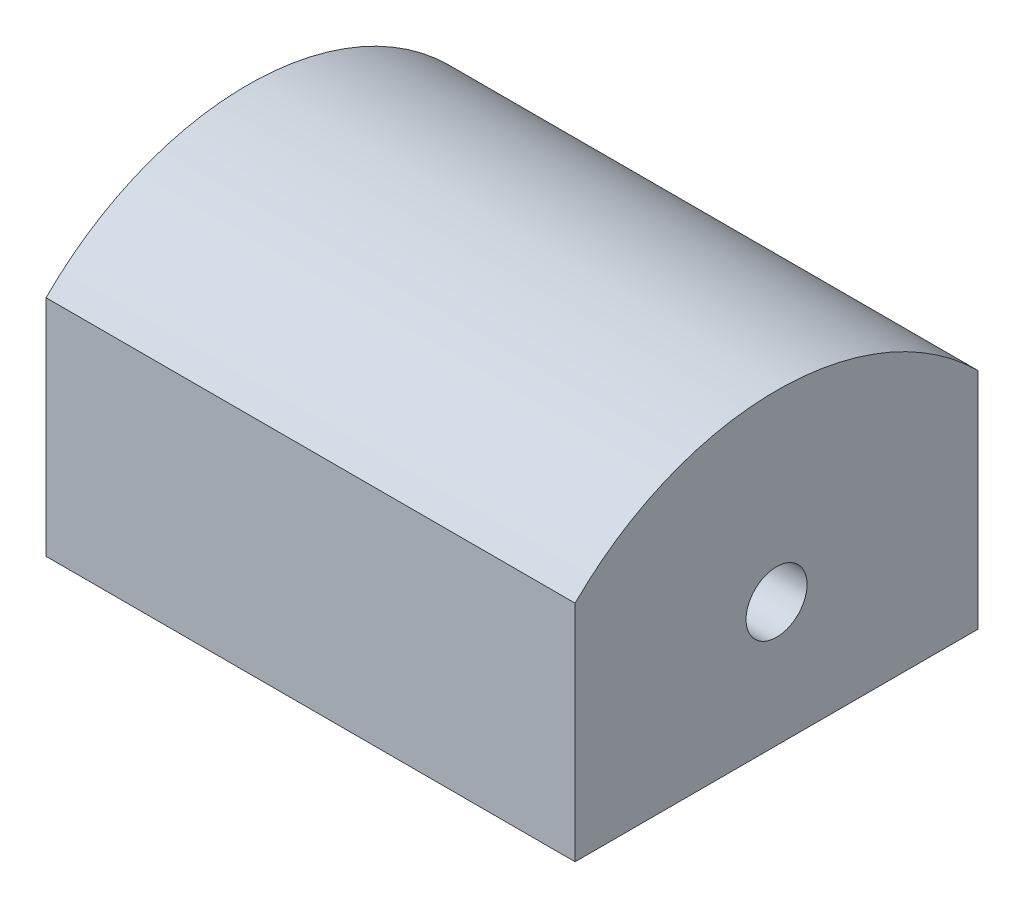
ISO-10303-21;
HEADER;
FILE_DESCRIPTION(('STEP AP214'),'2;1');
FILE_NAME('part.step','',(''),(''),'','','');
FILE_SCHEMA(('AUTOMOTIVE_DESIGN { 1 0 10303 214 1 1 1 1 }'));
ENDSEC;
DATA;
#1=APPLICATION_CONTEXT('core data for automotive mechanical design processes');
#2=APPLICATION_PROTOCOL_DEFINITION('international standard','automotive_design',2000,#1);
#3=PRODUCT_CONTEXT('',#1,'mechanical');
#4=PRODUCT('Part','Part','',(#3));
#5=PRODUCT_RELATED_PRODUCT_CATEGORY('part','',(#4));
#6=PRODUCT_DEFINITION_FORMATION('','',#4);
#7=PRODUCT_DEFINITION_CONTEXT('part definition',#1,'design');
#8=PRODUCT_DEFINITION('design','',#6,#7);
#9=PRODUCT_DEFINITION_SHAPE('','',#8);
#10=(LENGTH_UNIT() NAMED_UNIT(*) SI_UNIT(.MILLI.,.METRE.));
#11=(NAMED_UNIT(*) PLANE_ANGLE_UNIT() SI_UNIT($,.RADIAN.));
#12=(NAMED_UNIT(*) SI_UNIT($,.STERADIAN.) SOLID_ANGLE_UNIT());
#13=UNCERTAINTY_MEASURE_WITH_UNIT(LENGTH_MEASURE(1.E-05),#10,'distance_accuracy_value','');
#14=(GEOMETRIC_REPRESENTATION_CONTEXT(3) GLOBAL_UNCERTAINTY_ASSIGNED_CONTEXT((#13)) GLOBAL_UNIT_ASSIGNED_CONTEXT((#10,
#11,#12)) REPRESENTATION_CONTEXT('',''));
#15=CARTESIAN_POINT('',(0.,0.,0.));
#16=DIRECTION('',(0.,0.,1.));
#17=DIRECTION('',(1.,0.,0.));
#18=AXIS2_PLACEMENT_3D('',#15,#16,#17);
#19=CARTESIAN_POINT('',(13.,5.50382367744455,0.));
#20=DIRECTION('',(0.,0.,1.));
#21=DIRECTION('',(1.,0.,0.));
#22=AXIS2_PLACEMENT_3D('',#19,#20,#21);
#23=PLANE('',#22);
#24=DIRECTION('',(0.,1.,0.));
#25=VECTOR('',#24,1.);
#26=CARTESIAN_POINT('',(0.,5.50382367744455,0.));
#27=LINE('',#26,#25);
#28=CARTESIAN_POINT('',(0.,0.,0.));
#29=VERTEX_POINT('',#28);
#30=CARTESIAN_POINT('',(0.,5.50382367744455,0.));
#31=VERTEX_POINT('',#30);
#32=EDGE_CURVE('E107',#29,#31,#27,.T.);
#33=ORIENTED_EDGE('',*,*,#32,.T.);
#34=DIRECTION('',(-1.,0.,0.));
#35=VECTOR('',#34,1.);
#36=CARTESIAN_POINT('',(13.,5.50382367744455,0.));
#37=LINE('',#36,#35);
#38=CARTESIAN_POINT('',(13.,5.50382367744455,0.));
#39=VERTEX_POINT('',#38);
#40=EDGE_CURVE('E11',#39,#31,#37,.T.);
#41=ORIENTED_EDGE('',*,*,#40,.F.);
#42=DIRECTION('',(0.,1.,0.));
#43=VECTOR('',#42,1.);
#44=CARTESIAN_POINT('',(13.,5.50382367744455,0.));
#45=LINE('',#44,#43);
#46=CARTESIAN_POINT('',(13.,0.,0.));
#47=VERTEX_POINT('',#46);
#48=EDGE_CURVE('E91',#47,#39,#45,.T.);
#49=ORIENTED_EDGE('',*,*,#48,.F.);
#50=DIRECTION('',(-1.,0.,0.));
#51=VECTOR('',#50,1.);
#52=CARTESIAN_POINT('',(13.,0.,0.));
#53=LINE('',#52,#51);
#54=EDGE_CURVE('E103',#47,#29,#53,.T.);
#55=ORIENTED_EDGE('',*,*,#54,.T.);
#56=EDGE_LOOP('',(#33,#41,#49,#55));
#57=FACE_BOUND('',#56,.T.);
#58=ADVANCED_FACE('F39',(#57),#23,.F.);
#59=CARTESIAN_POINT('',(13.,0.55407620913872,4.94974746830584));
#60=DIRECTION('',(-1.,0.,0.));
#61=DIRECTION('',(0.,0.,1.));
#62=AXIS2_PLACEMENT_3D('',#59,#60,#61);
#63=CYLINDRICAL_SURFACE('',#62,7.);
#64=CARTESIAN_POINT('',(0.,0.55407620913872,4.94974746830584));
#65=DIRECTION('',(1.,0.,0.));
#66=DIRECTION('',(0.,0.,1.));
#67=AXIS2_PLACEMENT_3D('',#64,#65,#66);
#68=CIRCLE('',#67,7.);
#69=CARTESIAN_POINT('',(0.,5.50382367744455,9.89949493661167));
#70=VERTEX_POINT('',#69);
#71=EDGE_CURVE('E96',#31,#70,#68,.T.);
#72=ORIENTED_EDGE('',*,*,#71,.T.);
#73=DIRECTION('',(-1.,0.,0.));
#74=VECTOR('',#73,1.);
#75=CARTESIAN_POINT('',(13.,5.50382367744455,9.89949493661167));
#76=LINE('',#75,#74);
#77=CARTESIAN_POINT('',(13.,5.50382367744455,9.89949493661167));
#78=VERTEX_POINT('',#77);
#79=EDGE_CURVE('E48',#78,#70,#76,.T.);
#80=ORIENTED_EDGE('',*,*,#79,.F.);
#81=CARTESIAN_POINT('',(13.,0.55407620913872,4.94974746830584));
#82=DIRECTION('',(1.,0.,0.));
#83=DIRECTION('',(0.,0.,1.));
#84=AXIS2_PLACEMENT_3D('',#81,#82,#83);
#85=CIRCLE('',#84,7.);
#86=EDGE_CURVE('E86',#39,#78,#85,.T.);
#87=ORIENTED_EDGE('',*,*,#86,.F.);
#88=ORIENTED_EDGE('',*,*,#40,.T.);
#89=EDGE_LOOP('',(#72,#80,#87,#88));
#90=FACE_BOUND('',#89,.T.);
#91=ADVANCED_FACE('F95',(#90),#63,.T.);
#92=CARTESIAN_POINT('',(13.,0.,9.89949493661167));
#93=DIRECTION('',(0.,0.,-1.));
#94=DIRECTION('',(-1.,0.,0.));
#95=AXIS2_PLACEMENT_3D('',#92,#93,#94);
#96=PLANE('',#95);
#97=DIRECTION('',(0.,-1.,0.));
#98=VECTOR('',#97,1.);
#99=CARTESIAN_POINT('',(0.,0.,9.89949493661167));
#100=LINE('',#99,#98);
#101=CARTESIAN_POINT('',(0.,0.,9.89949493661167));
#102=VERTEX_POINT('',#101);
#103=EDGE_CURVE('E73',#70,#102,#100,.T.);
#104=ORIENTED_EDGE('',*,*,#103,.T.);
#105=DIRECTION('',(-1.,0.,0.));
#106=VECTOR('',#105,1.);
#107=CARTESIAN_POINT('',(13.,0.,9.89949493661167));
#108=LINE('',#107,#106);
#109=CARTESIAN_POINT('',(13.,0.,9.89949493661167));
#110=VERTEX_POINT('',#109);
#111=EDGE_CURVE('E98',#110,#102,#108,.T.);
#112=ORIENTED_EDGE('',*,*,#111,.F.);
#113=DIRECTION('',(0.,-1.,0.));
#114=VECTOR('',#113,1.);
#115=CARTESIAN_POINT('',(13.,0.,9.89949493661167));
#116=LINE('',#115,#114);
#117=EDGE_CURVE('E89',#78,#110,#116,.T.);
#118=ORIENTED_EDGE('',*,*,#117,.F.);
#119=ORIENTED_EDGE('',*,*,#79,.T.);
#120=EDGE_LOOP('',(#104,#112,#118,#119));
#121=FACE_BOUND('',#120,.T.);
#122=ADVANCED_FACE('F99',(#121),#96,.F.);
#123=CARTESIAN_POINT('',(13.,0.,0.));
#124=DIRECTION('',(0.,1.,0.));
#125=DIRECTION('',(0.,0.,1.));
#126=AXIS2_PLACEMENT_3D('',#123,#124,#125);
#127=PLANE('',#126);
#128=DIRECTION('',(0.,0.,-1.));
#129=VECTOR('',#128,1.);
#130=CARTESIAN_POINT('',(0.,0.,0.));
#131=LINE('',#130,#129);
#132=EDGE_CURVE('E79',#102,#29,#131,.T.);
#133=ORIENTED_EDGE('',*,*,#132,.T.);
#134=ORIENTED_EDGE('',*,*,#54,.F.);
#135=DIRECTION('',(0.,0.,-1.));
#136=VECTOR('',#135,1.);
#137=CARTESIAN_POINT('',(13.,0.,0.));
#138=LINE('',#137,#136);
#139=EDGE_CURVE('E56',#110,#47,#138,.T.);
#140=ORIENTED_EDGE('',*,*,#139,.F.);
#141=ORIENTED_EDGE('',*,*,#111,.T.);
#142=EDGE_LOOP('',(#133,#134,#140,#141));
#143=FACE_BOUND('',#142,.T.);
#144=ADVANCED_FACE('F121',(#143),#127,.F.);
#145=CARTESIAN_POINT('',(13.,0.55407620913872,4.94974746830584));
#146=DIRECTION('',(-1.,0.,0.));
#147=DIRECTION('',(0.,0.,1.));
#148=AXIS2_PLACEMENT_3D('',#145,#146,#147);
#149=PLANE('',#148);
#150=CARTESIAN_POINT('',(13.,3.05407620913872,4.94974746830584));
#151=DIRECTION('',(1.,0.,0.));
#152=DIRECTION('',(0.,0.,-1.));
#153=AXIS2_PLACEMENT_3D('',#150,#151,#152);
#154=CIRCLE('',#153,0.749999999999987);
#155=CARTESIAN_POINT('',(13.,3.05407620913872,4.19974746830585));
#156=VERTEX_POINT('',#155);
#157=EDGE_CURVE('E131',#156,#156,#154,.T.);
#158=ORIENTED_EDGE('',*,*,#157,.F.);
#159=EDGE_LOOP('',(#158));
#160=FACE_BOUND('',#159,.T.);
#161=ORIENTED_EDGE('',*,*,#48,.T.);
#162=ORIENTED_EDGE('',*,*,#86,.T.);
#163=ORIENTED_EDGE('',*,*,#117,.T.);
#164=ORIENTED_EDGE('',*,*,#139,.T.);
#165=EDGE_LOOP('',(#161,#162,#163,#164));
#166=FACE_BOUND('',#165,.T.);
#167=ADVANCED_FACE('F87',(#160,#166),#149,.F.);
#168=CARTESIAN_POINT('',(0.,0.55407620913872,4.94974746830584));
#169=DIRECTION('',(-1.,0.,0.));
#170=DIRECTION('',(0.,0.,1.));
#171=AXIS2_PLACEMENT_3D('',#168,#169,#170);
#172=PLANE('',#171);
#173=CARTESIAN_POINT('',(0.,3.05407620913872,4.94974746830584));
#174=DIRECTION('',(1.,0.,0.));
#175=DIRECTION('',(0.,0.,-1.));
#176=AXIS2_PLACEMENT_3D('',#173,#174,#175);
#177=CIRCLE('',#176,0.749999999999997);
#178=CARTESIAN_POINT('',(0.,3.05407620913872,4.19974746830584));
#179=VERTEX_POINT('',#178);
#180=EDGE_CURVE('E111',#179,#179,#177,.T.);
#181=ORIENTED_EDGE('',*,*,#180,.T.);
#182=EDGE_LOOP('',(#181));
#183=FACE_BOUND('',#182,.T.);
#184=ORIENTED_EDGE('',*,*,#32,.F.);
#185=ORIENTED_EDGE('',*,*,#132,.F.);
#186=ORIENTED_EDGE('',*,*,#103,.F.);
#187=ORIENTED_EDGE('',*,*,#71,.F.);
#188=EDGE_LOOP('',(#184,#185,#186,#187));
#189=FACE_BOUND('',#188,.T.);
#190=ADVANCED_FACE('F124',(#183,#189),#172,.T.);
#191=CARTESIAN_POINT('',(13.,3.05407620913872,4.94974746830584));
#192=DIRECTION('',(1.,0.,0.));
#193=DIRECTION('',(0.,0.,-1.));
#194=AXIS2_PLACEMENT_3D('',#191,#192,#193);
#195=CYLINDRICAL_SURFACE('',#194,0.749999999999992);
#196=ORIENTED_EDGE('',*,*,#180,.F.);
#197=EDGE_LOOP('',(#196));
#198=FACE_BOUND('',#197,.T.);
#199=ORIENTED_EDGE('',*,*,#157,.T.);
#200=EDGE_LOOP('',(#199));
#201=FACE_BOUND('',#200,.T.);
#202=ADVANCED_FACE('F136',(#198,#201),#195,.F.);
#203=CLOSED_SHELL('',(#58,#91,#122,#144,#167,#190,#202));
#204=MANIFOLD_SOLID_BREP('B2',#203);
#205=ADVANCED_BREP_SHAPE_REPRESENTATION('',(#18,#204),#14);
#206=SHAPE_DEFINITION_REPRESENTATION(#9,#205);
ENDSEC;
END-ISO-10303-21;
